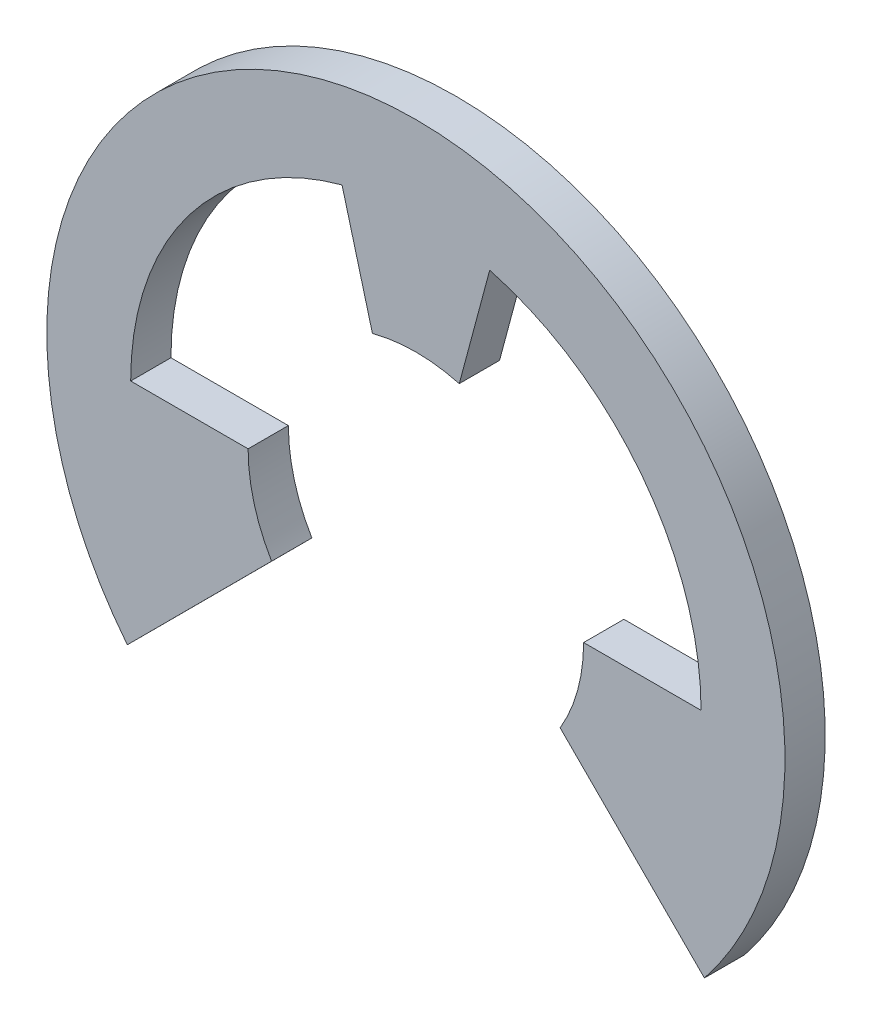
ISO-10303-21;
HEADER;
FILE_DESCRIPTION(('STEP AP214'),'2;1');
FILE_NAME('part.step','',(''),(''),'','','');
FILE_SCHEMA(('AUTOMOTIVE_DESIGN { 1 0 10303 214 1 1 1 1 }'));
ENDSEC;
DATA;
#1=APPLICATION_CONTEXT('core data for automotive mechanical design processes');
#2=APPLICATION_PROTOCOL_DEFINITION('international standard','automotive_design',2000,#1);
#3=PRODUCT_CONTEXT('',#1,'mechanical');
#4=PRODUCT('Part','Part','',(#3));
#5=PRODUCT_RELATED_PRODUCT_CATEGORY('part','',(#4));
#6=PRODUCT_DEFINITION_FORMATION('','',#4);
#7=PRODUCT_DEFINITION_CONTEXT('part definition',#1,'design');
#8=PRODUCT_DEFINITION('design','',#6,#7);
#9=PRODUCT_DEFINITION_SHAPE('','',#8);
#10=(LENGTH_UNIT() NAMED_UNIT(*) SI_UNIT(.MILLI.,.METRE.));
#11=(NAMED_UNIT(*) PLANE_ANGLE_UNIT() SI_UNIT($,.RADIAN.));
#12=(NAMED_UNIT(*) SI_UNIT($,.STERADIAN.) SOLID_ANGLE_UNIT());
#13=UNCERTAINTY_MEASURE_WITH_UNIT(LENGTH_MEASURE(1.E-05),#10,'distance_accuracy_value','');
#14=(GEOMETRIC_REPRESENTATION_CONTEXT(3) GLOBAL_UNCERTAINTY_ASSIGNED_CONTEXT((#13)) GLOBAL_UNIT_ASSIGNED_CONTEXT((#10,
#11,#12)) REPRESENTATION_CONTEXT('',''));
#15=CARTESIAN_POINT('',(0.,0.,0.));
#16=DIRECTION('',(0.,0.,1.));
#17=DIRECTION('',(1.,0.,0.));
#18=AXIS2_PLACEMENT_3D('',#15,#16,#17);
#19=CARTESIAN_POINT('',(2.15,-1.27573508221731,-0.3));
#20=DIRECTION('',(-0.707689924536374,-0.706523156527584,0.));
#21=DIRECTION('',(0.706523156527584,-0.707689924536374,0.));
#22=AXIS2_PLACEMENT_3D('',#19,#20,#21);
#23=PLANE('',#22);
#24=CARTESIAN_POINT('',(2.15000000000002,-1.27573508221731,0.3));
#25=CARTESIAN_POINT('',(2.23958333333335,-1.36546635545394,0.3));
#26=CARTESIAN_POINT('',(2.32916666666669,-1.45519762869057,0.3));
#27=CARTESIAN_POINT('',(2.50833333333335,-1.63466017516383,0.3));
#28=CARTESIAN_POINT('',(2.59791666666669,-1.72439144840046,0.3));
#29=CARTESIAN_POINT('',(2.77708333333335,-1.90385399487373,0.3));
#30=CARTESIAN_POINT('',(2.86666666666669,-1.99358526811036,0.3));
#31=CARTESIAN_POINT('',(3.04583333333336,-2.17304781458362,0.3));
#32=CARTESIAN_POINT('',(3.13541666666669,-2.26277908782025,0.3));
#33=CARTESIAN_POINT('',(3.31458333333336,-2.44224163429351,0.3));
#34=CARTESIAN_POINT('',(3.40416666666669,-2.53197290753015,0.3));
#35=CARTESIAN_POINT('',(3.58333333333336,-2.71143545400341,0.3));
#36=CARTESIAN_POINT('',(3.67291666666669,-2.80116672724004,0.3));
#37=CARTESIAN_POINT('',(3.85208333333336,-2.9806292737133,0.3));
#38=CARTESIAN_POINT('',(3.9416666666667,-3.07036054694993,0.3));
#39=CARTESIAN_POINT('',(4.12083333333336,-3.2498230934232,0.3));
#40=CARTESIAN_POINT('',(4.2104166666667,-3.33955436665983,0.3));
#41=CARTESIAN_POINT('',(4.30000000000003,-3.42928563989646,0.3));
#42=B_SPLINE_CURVE_WITH_KNOTS('',3,(#24,#25,#26,#27,#28,#29,#30,#31,#32,#33,#34,#35,#36,#37,#38,
#39,#40,#41),.UNSPECIFIED.,.F.,.F.,(4,2,2,2,2,2,2,2,4),(0.,0.380383852272942,0.760767704545884,
1.14115155681883,1.52153540909177,1.90191926136471,2.28230311363765,2.6626869659106,
3.04307081818354),.UNSPECIFIED.);
#43=CARTESIAN_POINT('',(2.15000009305852,-1.2757351754295,0.3));
#44=VERTEX_POINT('',#43);
#45=CARTESIAN_POINT('',(4.29999999999999,-3.42928563989646,0.3));
#46=VERTEX_POINT('',#45);
#47=EDGE_CURVE('E126',#44,#46,#42,.T.);
#48=ORIENTED_EDGE('',*,*,#47,.F.);
#49=DIRECTION('',(0.,0.,1.));
#50=VECTOR('',#49,1.);
#51=CARTESIAN_POINT('',(2.14999999999999,-1.27573508221731,0.));
#52=LINE('',#51,#50);
#53=CARTESIAN_POINT('',(2.14999999999999,-1.27573508221731,-0.3));
#54=VERTEX_POINT('',#53);
#55=EDGE_CURVE('E238',#54,#44,#52,.T.);
#56=ORIENTED_EDGE('',*,*,#55,.F.);
#57=CARTESIAN_POINT('',(4.30000000000003,-3.42928563989646,-0.3));
#58=CARTESIAN_POINT('',(4.2104166666667,-3.33955436665983,-0.3));
#59=CARTESIAN_POINT('',(4.12083333333336,-3.2498230934232,-0.3));
#60=CARTESIAN_POINT('',(3.94166666666669,-3.07036054694993,-0.3));
#61=CARTESIAN_POINT('',(3.85208333333336,-2.9806292737133,-0.3));
#62=CARTESIAN_POINT('',(3.67291666666669,-2.80116672724004,-0.3));
#63=CARTESIAN_POINT('',(3.58333333333336,-2.71143545400341,-0.3));
#64=CARTESIAN_POINT('',(3.40416666666669,-2.53197290753015,-0.3));
#65=CARTESIAN_POINT('',(3.31458333333336,-2.44224163429351,-0.3));
#66=CARTESIAN_POINT('',(3.13541666666669,-2.26277908782025,-0.3));
#67=CARTESIAN_POINT('',(3.04583333333335,-2.17304781458362,-0.3));
#68=CARTESIAN_POINT('',(2.86666666666669,-1.99358526811036,-0.3));
#69=CARTESIAN_POINT('',(2.77708333333335,-1.90385399487373,-0.3));
#70=CARTESIAN_POINT('',(2.59791666666668,-1.72439144840046,-0.3));
#71=CARTESIAN_POINT('',(2.50833333333335,-1.63466017516383,-0.3));
#72=CARTESIAN_POINT('',(2.32916666666668,-1.45519762869057,-0.3));
#73=CARTESIAN_POINT('',(2.23958333333335,-1.36546635545394,-0.3));
#74=CARTESIAN_POINT('',(2.15000000000001,-1.27573508221731,-0.3));
#75=B_SPLINE_CURVE_WITH_KNOTS('',3,(#57,#58,#59,#60,#61,#62,#63,#64,#65,#66,#67,#68,#69,#70,#71,
#72,#73,#74),.UNSPECIFIED.,.F.,.F.,(4,2,2,2,2,2,2,2,4),(0.,0.380383852272942,0.760767704545885,
1.14115155681883,1.52153540909177,1.90191926136471,2.28230311363765,2.6626869659106,
3.04307081818354),.UNSPECIFIED.);
#76=CARTESIAN_POINT('',(4.29999988915185,-3.42928552886524,-0.3));
#77=VERTEX_POINT('',#76);
#78=EDGE_CURVE('E190',#77,#54,#75,.T.);
#79=ORIENTED_EDGE('',*,*,#78,.F.);
#80=DIRECTION('',(0.,0.,-1.));
#81=VECTOR('',#80,1.);
#82=CARTESIAN_POINT('',(4.29999999999999,-3.42928563989646,0.));
#83=LINE('',#82,#81);
#84=EDGE_CURVE('E129',#46,#77,#83,.T.);
#85=ORIENTED_EDGE('',*,*,#84,.F.);
#86=EDGE_LOOP('',(#48,#56,#79,#85));
#87=FACE_BOUND('',#86,.T.);
#88=ADVANCED_FACE('F15',(#87),#23,.T.);
#89=CARTESIAN_POINT('',(0.,0.,0.3));
#90=DIRECTION('',(0.,0.,-1.));
#91=DIRECTION('',(-1.,0.,0.));
#92=AXIS2_PLACEMENT_3D('',#89,#90,#91);
#93=CYLINDRICAL_SURFACE('',#92,2.5);
#94=CARTESIAN_POINT('',(0.,0.,0.3));
#95=DIRECTION('',(0.,0.,-1.));
#96=DIRECTION('',(-1.,0.,0.));
#97=AXIS2_PLACEMENT_3D('',#94,#95,#96);
#98=CIRCLE('',#97,2.5);
#99=CARTESIAN_POINT('',(2.5,0.,0.3));
#100=VERTEX_POINT('',#99);
#101=EDGE_CURVE('E191',#100,#44,#98,.T.);
#102=ORIENTED_EDGE('',*,*,#101,.F.);
#103=DIRECTION('',(0.,0.,1.));
#104=VECTOR('',#103,1.);
#105=CARTESIAN_POINT('',(2.5,0.,0.));
#106=LINE('',#105,#104);
#107=CARTESIAN_POINT('',(2.5,0.,-0.3));
#108=VERTEX_POINT('',#107);
#109=EDGE_CURVE('E233',#108,#100,#106,.T.);
#110=ORIENTED_EDGE('',*,*,#109,.F.);
#111=CARTESIAN_POINT('',(0.,0.,-0.3));
#112=DIRECTION('',(0.,0.,-1.));
#113=DIRECTION('',(-1.,0.,0.));
#114=AXIS2_PLACEMENT_3D('',#111,#112,#113);
#115=CIRCLE('',#114,2.5);
#116=EDGE_CURVE('E187',#54,#108,#115,.F.);
#117=ORIENTED_EDGE('',*,*,#116,.F.);
#118=ORIENTED_EDGE('',*,*,#55,.T.);
#119=EDGE_LOOP('',(#102,#110,#117,#118));
#120=FACE_BOUND('',#119,.T.);
#121=ADVANCED_FACE('F289',(#120),#93,.F.);
#122=CARTESIAN_POINT('',(2.5,0.,-0.3));
#123=DIRECTION('',(0.,1.,0.));
#124=DIRECTION('',(0.,0.,1.));
#125=AXIS2_PLACEMENT_3D('',#122,#123,#124);
#126=PLANE('',#125);
#127=DIRECTION('',(-1.,0.,0.));
#128=VECTOR('',#127,1.);
#129=CARTESIAN_POINT('',(0.,0.,0.3));
#130=LINE('',#129,#128);
#131=CARTESIAN_POINT('',(4.25,0.,0.3));
#132=VERTEX_POINT('',#131);
#133=EDGE_CURVE('E194',#132,#100,#130,.T.);
#134=ORIENTED_EDGE('',*,*,#133,.F.);
#135=DIRECTION('',(0.,0.,1.));
#136=VECTOR('',#135,1.);
#137=CARTESIAN_POINT('',(4.25,0.,0.));
#138=LINE('',#137,#136);
#139=CARTESIAN_POINT('',(4.25,0.,-0.3));
#140=VERTEX_POINT('',#139);
#141=EDGE_CURVE('E226',#140,#132,#138,.T.);
#142=ORIENTED_EDGE('',*,*,#141,.F.);
#143=DIRECTION('',(1.,0.,0.));
#144=VECTOR('',#143,1.);
#145=CARTESIAN_POINT('',(0.,0.,-0.3));
#146=LINE('',#145,#144);
#147=EDGE_CURVE('E186',#108,#140,#146,.T.);
#148=ORIENTED_EDGE('',*,*,#147,.F.);
#149=ORIENTED_EDGE('',*,*,#109,.T.);
#150=EDGE_LOOP('',(#134,#142,#148,#149));
#151=FACE_BOUND('',#150,.T.);
#152=ADVANCED_FACE('F235',(#151),#126,.T.);
#153=CARTESIAN_POINT('',(0.,0.,0.3));
#154=DIRECTION('',(0.,0.,-1.));
#155=DIRECTION('',(-1.,0.,0.));
#156=AXIS2_PLACEMENT_3D('',#153,#154,#155);
#157=CYLINDRICAL_SURFACE('',#156,4.25);
#158=CARTESIAN_POINT('',(0.,0.,0.3));
#159=DIRECTION('',(0.,0.,-1.));
#160=DIRECTION('',(-1.,0.,0.));
#161=AXIS2_PLACEMENT_3D('',#158,#159,#160);
#162=CIRCLE('',#161,4.25);
#163=CARTESIAN_POINT('',(1.09998094168572,4.10518476172854,0.3));
#164=VERTEX_POINT('',#163);
#165=EDGE_CURVE('E195',#164,#132,#162,.T.);
#166=ORIENTED_EDGE('',*,*,#165,.F.);
#167=DIRECTION('',(0.,0.,1.));
#168=VECTOR('',#167,1.);
#169=CARTESIAN_POINT('',(1.09998094168571,4.10518476172854,-0.3));
#170=LINE('',#169,#168);
#171=CARTESIAN_POINT('',(1.0999809416857,4.10518476172854,-0.3));
#172=VERTEX_POINT('',#171);
#173=EDGE_CURVE('E222',#172,#164,#170,.T.);
#174=ORIENTED_EDGE('',*,*,#173,.F.);
#175=CARTESIAN_POINT('',(0.,0.,-0.3));
#176=DIRECTION('',(0.,0.,-1.));
#177=DIRECTION('',(-1.,0.,0.));
#178=AXIS2_PLACEMENT_3D('',#175,#176,#177);
#179=CIRCLE('',#178,4.25);
#180=EDGE_CURVE('E183',#140,#172,#179,.F.);
#181=ORIENTED_EDGE('',*,*,#180,.F.);
#182=ORIENTED_EDGE('',*,*,#141,.T.);
#183=EDGE_LOOP('',(#166,#174,#181,#182));
#184=FACE_BOUND('',#183,.T.);
#185=ADVANCED_FACE('F228',(#184),#157,.F.);
#186=CARTESIAN_POINT('',(0.6470476127563,2.41481456572267,-0.3));
#187=DIRECTION('',(0.965925826289068,-0.25881904510252,0.));
#188=DIRECTION('',(0.25881904510252,0.965925826289068,0.));
#189=AXIS2_PLACEMENT_3D('',#186,#187,#188);
#190=PLANE('',#189);
#191=CARTESIAN_POINT('',(0.647047612756252,2.41481456572263,0.3));
#192=CARTESIAN_POINT('',(0.665919834794979,2.48524665722288,0.3));
#193=CARTESIAN_POINT('',(0.684792056833706,2.55567874872313,0.3));
#194=CARTESIAN_POINT('',(0.722536500911159,2.69654293172362,0.3));
#195=CARTESIAN_POINT('',(0.741408722949885,2.76697502322386,0.3));
#196=CARTESIAN_POINT('',(0.779153167027339,2.90783920622436,0.3));
#197=CARTESIAN_POINT('',(0.798025389066065,2.9782712977246,0.3));
#198=CARTESIAN_POINT('',(0.835769833143519,3.11913548072509,0.3));
#199=CARTESIAN_POINT('',(0.854642055182246,3.18956757222534,0.3));
#200=CARTESIAN_POINT('',(0.892386499259699,3.33043175522583,0.3));
#201=CARTESIAN_POINT('',(0.911258721298427,3.40086384672608,0.3));
#202=CARTESIAN_POINT('',(0.949003165375881,3.54172802972657,0.3));
#203=CARTESIAN_POINT('',(0.967875387414607,3.61216012122682,0.3));
#204=CARTESIAN_POINT('',(1.00561983149206,3.75302430422731,0.3));
#205=CARTESIAN_POINT('',(1.02449205353079,3.82345639572755,0.3));
#206=CARTESIAN_POINT('',(1.06223649760824,3.96432057872804,0.3));
#207=CARTESIAN_POINT('',(1.08110871964697,4.03475267022829,0.3));
#208=CARTESIAN_POINT('',(1.09998094168569,4.10518476172854,0.3));
#209=B_SPLINE_CURVE_WITH_KNOTS('',3,(#191,#192,#193,#194,#195,#196,#197,#198,#199,#200,#201,
#202,#203,#204,#205,#206,#207,#208),.UNSPECIFIED.,.F.,.F.,(4,2,2,2,2,2,2,2,4),(0.,
0.218750000000005,0.437500000000009,0.656250000000014,0.875000000000019,1.09375000000002,
1.31250000000003,1.53125000000003,1.75000000000004),.UNSPECIFIED.);
#210=CARTESIAN_POINT('',(0.647047612756282,2.41481456572265,0.3));
#211=VERTEX_POINT('',#210);
#212=EDGE_CURVE('E157',#211,#164,#209,.T.);
#213=ORIENTED_EDGE('',*,*,#212,.F.);
#214=DIRECTION('',(0.,0.,1.));
#215=VECTOR('',#214,1.);
#216=CARTESIAN_POINT('',(0.647047612756311,2.41481456572267,0.));
#217=LINE('',#216,#215);
#218=CARTESIAN_POINT('',(0.647047612756311,2.41481456572267,-0.3));
#219=VERTEX_POINT('',#218);
#220=EDGE_CURVE('E213',#219,#211,#217,.T.);
#221=ORIENTED_EDGE('',*,*,#220,.F.);
#222=CARTESIAN_POINT('',(1.09998094168569,4.10518476172854,-0.3));
#223=CARTESIAN_POINT('',(1.08110871964696,4.03475267022829,-0.3));
#224=CARTESIAN_POINT('',(1.06223649760824,3.96432057872804,-0.3));
#225=CARTESIAN_POINT('',(1.02449205353078,3.82345639572755,-0.3));
#226=CARTESIAN_POINT('',(1.00561983149206,3.75302430422731,-0.3));
#227=CARTESIAN_POINT('',(0.967875387414604,3.61216012122681,-0.3));
#228=CARTESIAN_POINT('',(0.949003165375878,3.54172802972657,-0.3));
#229=CARTESIAN_POINT('',(0.911258721298424,3.40086384672608,-0.3));
#230=CARTESIAN_POINT('',(0.892386499259698,3.33043175522583,-0.3));
#231=CARTESIAN_POINT('',(0.854642055182244,3.18956757222534,-0.3));
#232=CARTESIAN_POINT('',(0.835769833143516,3.11913548072509,-0.3));
#233=CARTESIAN_POINT('',(0.798025389066063,2.9782712977246,-0.3));
#234=CARTESIAN_POINT('',(0.779153167027336,2.90783920622436,-0.3));
#235=CARTESIAN_POINT('',(0.741408722949883,2.76697502322386,-0.3));
#236=CARTESIAN_POINT('',(0.722536500911156,2.69654293172362,-0.3));
#237=CARTESIAN_POINT('',(0.684792056833702,2.55567874872313,-0.3));
#238=CARTESIAN_POINT('',(0.665919834794976,2.48524665722288,-0.3));
#239=CARTESIAN_POINT('',(0.647047612756249,2.41481456572263,-0.3));
#240=B_SPLINE_CURVE_WITH_KNOTS('',3,(#222,#223,#224,#225,#226,#227,#228,#229,#230,#231,#232,
#233,#234,#235,#236,#237,#238,#239),.UNSPECIFIED.,.F.,.F.,(4,2,2,2,2,2,2,2,4),(0.,
0.218750000000005,0.437500000000009,0.656250000000015,0.875000000000019,1.09375000000002,
1.31250000000003,1.53125000000003,1.75000000000004),.UNSPECIFIED.);
#241=EDGE_CURVE('E182',#172,#219,#240,.T.);
#242=ORIENTED_EDGE('',*,*,#241,.F.);
#243=ORIENTED_EDGE('',*,*,#173,.T.);
#244=EDGE_LOOP('',(#213,#221,#242,#243));
#245=FACE_BOUND('',#244,.T.);
#246=ADVANCED_FACE('F220',(#245),#190,.T.);
#247=CARTESIAN_POINT('',(0.,0.,0.3));
#248=DIRECTION('',(0.,0.,-1.));
#249=DIRECTION('',(-1.,0.,0.));
#250=AXIS2_PLACEMENT_3D('',#247,#248,#249);
#251=CYLINDRICAL_SURFACE('',#250,2.5);
#252=CARTESIAN_POINT('',(0.,0.,0.3));
#253=DIRECTION('',(0.,0.,-1.));
#254=DIRECTION('',(-1.,0.,0.));
#255=AXIS2_PLACEMENT_3D('',#252,#253,#254);
#256=CIRCLE('',#255,2.5);
#257=CARTESIAN_POINT('',(-0.647047612756298,2.41481456572267,0.3));
#258=VERTEX_POINT('',#257);
#259=EDGE_CURVE('E163',#258,#211,#256,.T.);
#260=ORIENTED_EDGE('',*,*,#259,.F.);
#261=DIRECTION('',(0.,0.,1.));
#262=VECTOR('',#261,1.);
#263=CARTESIAN_POINT('',(-0.6470476127563,2.41481456572267,-0.3));
#264=LINE('',#263,#262);
#265=CARTESIAN_POINT('',(-0.647047612756276,2.41481456572265,-0.3));
#266=VERTEX_POINT('',#265);
#267=EDGE_CURVE('E207',#266,#258,#264,.T.);
#268=ORIENTED_EDGE('',*,*,#267,.F.);
#269=CARTESIAN_POINT('',(0.,0.,-0.3));
#270=DIRECTION('',(0.,0.,-1.));
#271=DIRECTION('',(-1.,0.,0.));
#272=AXIS2_PLACEMENT_3D('',#269,#270,#271);
#273=CIRCLE('',#272,2.5);
#274=EDGE_CURVE('E179',#219,#266,#273,.F.);
#275=ORIENTED_EDGE('',*,*,#274,.F.);
#276=ORIENTED_EDGE('',*,*,#220,.T.);
#277=EDGE_LOOP('',(#260,#268,#275,#276));
#278=FACE_BOUND('',#277,.T.);
#279=ADVANCED_FACE('F215',(#278),#251,.F.);
#280=CARTESIAN_POINT('',(-1.09998094168571,4.10518476172854,-0.3));
#281=DIRECTION('',(-0.965925826289068,-0.25881904510252,0.));
#282=DIRECTION('',(0.25881904510252,-0.965925826289068,0.));
#283=AXIS2_PLACEMENT_3D('',#280,#281,#282);
#284=PLANE('',#283);
#285=CARTESIAN_POINT('',(-1.09998094168569,4.10518476172854,0.3));
#286=CARTESIAN_POINT('',(-1.08110871964696,4.03475267022829,0.3));
#287=CARTESIAN_POINT('',(-1.06223649760824,3.96432057872804,0.3));
#288=CARTESIAN_POINT('',(-1.02449205353078,3.82345639572755,0.3));
#289=CARTESIAN_POINT('',(-1.00561983149206,3.75302430422731,0.3));
#290=CARTESIAN_POINT('',(-0.967875387414604,3.61216012122682,0.3));
#291=CARTESIAN_POINT('',(-0.949003165375878,3.54172802972657,0.3));
#292=CARTESIAN_POINT('',(-0.911258721298424,3.40086384672608,0.3));
#293=CARTESIAN_POINT('',(-0.892386499259698,3.33043175522583,0.3));
#294=CARTESIAN_POINT('',(-0.854642055182244,3.18956757222534,0.3));
#295=CARTESIAN_POINT('',(-0.835769833143516,3.11913548072509,0.3));
#296=CARTESIAN_POINT('',(-0.798025389066063,2.9782712977246,0.3));
#297=CARTESIAN_POINT('',(-0.779153167027336,2.90783920622436,0.3));
#298=CARTESIAN_POINT('',(-0.741408722949883,2.76697502322386,0.3));
#299=CARTESIAN_POINT('',(-0.722536500911156,2.69654293172362,0.3));
#300=CARTESIAN_POINT('',(-0.684792056833702,2.55567874872313,0.3));
#301=CARTESIAN_POINT('',(-0.665919834794976,2.48524665722288,0.3));
#302=CARTESIAN_POINT('',(-0.647047612756249,2.41481456572263,0.3));
#303=B_SPLINE_CURVE_WITH_KNOTS('',3,(#285,#286,#287,#288,#289,#290,#291,#292,#293,#294,#295,
#296,#297,#298,#299,#300,#301,#302),.UNSPECIFIED.,.F.,.F.,(4,2,2,2,2,2,2,2,4),(0.,
0.218750000000005,0.437500000000009,0.656250000000014,0.875000000000019,1.09375000000002,
1.31250000000003,1.53125000000003,1.75000000000004),.UNSPECIFIED.);
#304=CARTESIAN_POINT('',(-1.0999809416857,4.10518476172854,0.3));
#305=VERTEX_POINT('',#304);
#306=EDGE_CURVE('E160',#305,#258,#303,.T.);
#307=ORIENTED_EDGE('',*,*,#306,.F.);
#308=DIRECTION('',(0.,0.,1.));
#309=VECTOR('',#308,1.);
#310=CARTESIAN_POINT('',(-1.0999809416857,4.10518476172854,0.));
#311=LINE('',#310,#309);
#312=CARTESIAN_POINT('',(-1.0999809416857,4.10518476172854,-0.3));
#313=VERTEX_POINT('',#312);
#314=EDGE_CURVE('E203',#313,#305,#311,.T.);
#315=ORIENTED_EDGE('',*,*,#314,.F.);
#316=CARTESIAN_POINT('',(-0.647047612756252,2.41481456572263,-0.3));
#317=CARTESIAN_POINT('',(-0.665919834794979,2.48524665722288,-0.3));
#318=CARTESIAN_POINT('',(-0.684792056833706,2.55567874872313,-0.3));
#319=CARTESIAN_POINT('',(-0.722536500911159,2.69654293172362,-0.3));
#320=CARTESIAN_POINT('',(-0.741408722949885,2.76697502322386,-0.3));
#321=CARTESIAN_POINT('',(-0.779153167027339,2.90783920622436,-0.3));
#322=CARTESIAN_POINT('',(-0.798025389066065,2.9782712977246,-0.3));
#323=CARTESIAN_POINT('',(-0.835769833143519,3.11913548072509,-0.3));
#324=CARTESIAN_POINT('',(-0.854642055182246,3.18956757222534,-0.3));
#325=CARTESIAN_POINT('',(-0.892386499259699,3.33043175522583,-0.3));
#326=CARTESIAN_POINT('',(-0.911258721298427,3.40086384672608,-0.3));
#327=CARTESIAN_POINT('',(-0.949003165375881,3.54172802972657,-0.3));
#328=CARTESIAN_POINT('',(-0.967875387414607,3.61216012122682,-0.3));
#329=CARTESIAN_POINT('',(-1.00561983149206,3.75302430422731,-0.3));
#330=CARTESIAN_POINT('',(-1.02449205353079,3.82345639572755,-0.3));
#331=CARTESIAN_POINT('',(-1.06223649760824,3.96432057872804,-0.3));
#332=CARTESIAN_POINT('',(-1.08110871964697,4.03475267022829,-0.3));
#333=CARTESIAN_POINT('',(-1.09998094168569,4.10518476172854,-0.3));
#334=B_SPLINE_CURVE_WITH_KNOTS('',3,(#316,#317,#318,#319,#320,#321,#322,#323,#324,#325,#326,
#327,#328,#329,#330,#331,#332,#333),.UNSPECIFIED.,.F.,.F.,(4,2,2,2,2,2,2,2,4),(0.,
0.218750000000005,0.437500000000009,0.656250000000014,0.875000000000019,1.09375000000002,
1.31250000000003,1.53125000000003,1.75000000000004),.UNSPECIFIED.);
#335=EDGE_CURVE('E178',#266,#313,#334,.T.);
#336=ORIENTED_EDGE('',*,*,#335,.F.);
#337=ORIENTED_EDGE('',*,*,#267,.T.);
#338=EDGE_LOOP('',(#307,#315,#336,#337));
#339=FACE_BOUND('',#338,.T.);
#340=ADVANCED_FACE('F209',(#339),#284,.T.);
#341=CARTESIAN_POINT('',(0.,0.,0.3));
#342=DIRECTION('',(0.,0.,-1.));
#343=DIRECTION('',(-1.,0.,0.));
#344=AXIS2_PLACEMENT_3D('',#341,#342,#343);
#345=CYLINDRICAL_SURFACE('',#344,4.25);
#346=CARTESIAN_POINT('',(0.,0.,0.3));
#347=DIRECTION('',(0.,0.,-1.));
#348=DIRECTION('',(-1.,0.,0.));
#349=AXIS2_PLACEMENT_3D('',#346,#347,#348);
#350=CIRCLE('',#349,4.25);
#351=CARTESIAN_POINT('',(-4.25,0.,0.3));
#352=VERTEX_POINT('',#351);
#353=EDGE_CURVE('E120',#352,#305,#350,.T.);
#354=ORIENTED_EDGE('',*,*,#353,.F.);
#355=DIRECTION('',(0.,0.,1.));
#356=VECTOR('',#355,1.);
#357=CARTESIAN_POINT('',(-4.25,0.,0.));
#358=LINE('',#357,#356);
#359=CARTESIAN_POINT('',(-4.25,0.,-0.3));
#360=VERTEX_POINT('',#359);
#361=EDGE_CURVE('E112',#360,#352,#358,.T.);
#362=ORIENTED_EDGE('',*,*,#361,.F.);
#363=CARTESIAN_POINT('',(0.,0.,-0.3));
#364=DIRECTION('',(0.,0.,-1.));
#365=DIRECTION('',(-1.,0.,0.));
#366=AXIS2_PLACEMENT_3D('',#363,#364,#365);
#367=CIRCLE('',#366,4.25);
#368=EDGE_CURVE('E175',#313,#360,#367,.F.);
#369=ORIENTED_EDGE('',*,*,#368,.F.);
#370=ORIENTED_EDGE('',*,*,#314,.T.);
#371=EDGE_LOOP('',(#354,#362,#369,#370));
#372=FACE_BOUND('',#371,.T.);
#373=ADVANCED_FACE('F201',(#372),#345,.F.);
#374=CARTESIAN_POINT('',(-4.25,0.,-0.3));
#375=DIRECTION('',(0.,1.,0.));
#376=DIRECTION('',(0.,0.,1.));
#377=AXIS2_PLACEMENT_3D('',#374,#375,#376);
#378=PLANE('',#377);
#379=DIRECTION('',(-1.,0.,0.));
#380=VECTOR('',#379,1.);
#381=CARTESIAN_POINT('',(0.,0.,0.3));
#382=LINE('',#381,#380);
#383=CARTESIAN_POINT('',(-2.5,0.,0.3));
#384=VERTEX_POINT('',#383);
#385=EDGE_CURVE('E115',#384,#352,#382,.T.);
#386=ORIENTED_EDGE('',*,*,#385,.F.);
#387=DIRECTION('',(0.,0.,1.));
#388=VECTOR('',#387,1.);
#389=CARTESIAN_POINT('',(-2.5,0.,0.));
#390=LINE('',#389,#388);
#391=CARTESIAN_POINT('',(-2.5,0.,-0.3));
#392=VERTEX_POINT('',#391);
#393=EDGE_CURVE('E101',#392,#384,#390,.T.);
#394=ORIENTED_EDGE('',*,*,#393,.F.);
#395=DIRECTION('',(1.,0.,0.));
#396=VECTOR('',#395,1.);
#397=CARTESIAN_POINT('',(0.,0.,-0.3));
#398=LINE('',#397,#396);
#399=EDGE_CURVE('E174',#360,#392,#398,.T.);
#400=ORIENTED_EDGE('',*,*,#399,.F.);
#401=ORIENTED_EDGE('',*,*,#361,.T.);
#402=EDGE_LOOP('',(#386,#394,#400,#401));
#403=FACE_BOUND('',#402,.T.);
#404=ADVANCED_FACE('F116',(#403),#378,.T.);
#405=CARTESIAN_POINT('',(0.,0.,0.3));
#406=DIRECTION('',(0.,0.,-1.));
#407=DIRECTION('',(-1.,0.,0.));
#408=AXIS2_PLACEMENT_3D('',#405,#406,#407);
#409=CYLINDRICAL_SURFACE('',#408,2.5);
#410=CARTESIAN_POINT('',(0.,0.,0.3));
#411=DIRECTION('',(0.,0.,-1.));
#412=DIRECTION('',(-1.,0.,0.));
#413=AXIS2_PLACEMENT_3D('',#410,#411,#412);
#414=CIRCLE('',#413,2.5);
#415=CARTESIAN_POINT('',(-2.15,-1.27573508221731,0.3));
#416=VERTEX_POINT('',#415);
#417=EDGE_CURVE('E18',#416,#384,#414,.T.);
#418=ORIENTED_EDGE('',*,*,#417,.F.);
#419=DIRECTION('',(0.,0.,1.));
#420=VECTOR('',#419,1.);
#421=CARTESIAN_POINT('',(-2.15,-1.27573508221731,-0.3));
#422=LINE('',#421,#420);
#423=CARTESIAN_POINT('',(-2.15000000000001,-1.27573508221731,-0.3));
#424=VERTEX_POINT('',#423);
#425=EDGE_CURVE('E111',#424,#416,#422,.T.);
#426=ORIENTED_EDGE('',*,*,#425,.F.);
#427=CARTESIAN_POINT('',(0.,0.,-0.3));
#428=DIRECTION('',(0.,0.,-1.));
#429=DIRECTION('',(-1.,0.,0.));
#430=AXIS2_PLACEMENT_3D('',#427,#428,#429);
#431=CIRCLE('',#430,2.5);
#432=EDGE_CURVE('E107',#392,#424,#431,.F.);
#433=ORIENTED_EDGE('',*,*,#432,.F.);
#434=ORIENTED_EDGE('',*,*,#393,.T.);
#435=EDGE_LOOP('',(#418,#426,#433,#434));
#436=FACE_BOUND('',#435,.T.);
#437=ADVANCED_FACE('F103',(#436),#409,.F.);
#438=CARTESIAN_POINT('',(-4.3,-3.42928563989645,-0.3));
#439=DIRECTION('',(0.707689924536374,-0.706523156527584,0.));
#440=DIRECTION('',(0.706523156527584,0.707689924536374,0.));
#441=AXIS2_PLACEMENT_3D('',#438,#439,#440);
#442=PLANE('',#441);
#443=CARTESIAN_POINT('',(-4.30000000000003,-3.42928563989646,0.3));
#444=CARTESIAN_POINT('',(-4.2104166666667,-3.33955436665983,0.3));
#445=CARTESIAN_POINT('',(-4.12083333333336,-3.2498230934232,0.3));
#446=CARTESIAN_POINT('',(-3.94166666666669,-3.07036054694993,0.3));
#447=CARTESIAN_POINT('',(-3.85208333333336,-2.9806292737133,0.3));
#448=CARTESIAN_POINT('',(-3.67291666666669,-2.80116672724004,0.3));
#449=CARTESIAN_POINT('',(-3.58333333333336,-2.71143545400341,0.3));
#450=CARTESIAN_POINT('',(-3.40416666666669,-2.53197290753015,0.3));
#451=CARTESIAN_POINT('',(-3.31458333333336,-2.44224163429351,0.3));
#452=CARTESIAN_POINT('',(-3.13541666666669,-2.26277908782025,0.3));
#453=CARTESIAN_POINT('',(-3.04583333333335,-2.17304781458362,0.3));
#454=CARTESIAN_POINT('',(-2.86666666666669,-1.99358526811036,0.3));
#455=CARTESIAN_POINT('',(-2.77708333333335,-1.90385399487373,0.3));
#456=CARTESIAN_POINT('',(-2.59791666666668,-1.72439144840046,0.3));
#457=CARTESIAN_POINT('',(-2.50833333333335,-1.63466017516383,0.3));
#458=CARTESIAN_POINT('',(-2.32916666666668,-1.45519762869057,0.3));
#459=CARTESIAN_POINT('',(-2.23958333333335,-1.36546635545394,0.3));
#460=CARTESIAN_POINT('',(-2.15000000000001,-1.27573508221731,0.3));
#461=B_SPLINE_CURVE_WITH_KNOTS('',3,(#443,#444,#445,#446,#447,#448,#449,#450,#451,#452,#453,
#454,#455,#456,#457,#458,#459,#460),.UNSPECIFIED.,.F.,.F.,(4,2,2,2,2,2,2,2,4),(0.,
0.380383852272942,0.760767704545885,1.14115155681883,1.52153540909177,1.90191926136471,
2.28230311363765,2.6626869659106,3.04307081818354),.UNSPECIFIED.);
#462=CARTESIAN_POINT('',(-4.29999998583667,-3.42928562570972,0.3));
#463=VERTEX_POINT('',#462);
#464=EDGE_CURVE('E125',#463,#416,#461,.T.);
#465=ORIENTED_EDGE('',*,*,#464,.F.);
#466=DIRECTION('',(0.,0.,1.));
#467=VECTOR('',#466,1.);
#468=CARTESIAN_POINT('',(-4.3,-3.42928563989645,-0.3));
#469=LINE('',#468,#467);
#470=CARTESIAN_POINT('',(-4.29999988915185,-3.42928552886524,-0.3));
#471=VERTEX_POINT('',#470);
#472=EDGE_CURVE('E33',#463,#471,#469,.F.);
#473=ORIENTED_EDGE('',*,*,#472,.T.);
#474=CARTESIAN_POINT('',(-2.15000000000002,-1.27573508221731,-0.3));
#475=CARTESIAN_POINT('',(-2.23958333333335,-1.36546635545394,-0.3));
#476=CARTESIAN_POINT('',(-2.32916666666669,-1.45519762869057,-0.3));
#477=CARTESIAN_POINT('',(-2.50833333333335,-1.63466017516383,-0.3));
#478=CARTESIAN_POINT('',(-2.59791666666669,-1.72439144840046,-0.3));
#479=CARTESIAN_POINT('',(-2.77708333333335,-1.90385399487373,-0.3));
#480=CARTESIAN_POINT('',(-2.86666666666669,-1.99358526811036,-0.3));
#481=CARTESIAN_POINT('',(-3.04583333333336,-2.17304781458362,-0.3));
#482=CARTESIAN_POINT('',(-3.13541666666669,-2.26277908782025,-0.3));
#483=CARTESIAN_POINT('',(-3.31458333333336,-2.44224163429351,-0.3));
#484=CARTESIAN_POINT('',(-3.40416666666669,-2.53197290753015,-0.3));
#485=CARTESIAN_POINT('',(-3.58333333333336,-2.71143545400341,-0.3));
#486=CARTESIAN_POINT('',(-3.67291666666669,-2.80116672724004,-0.3));
#487=CARTESIAN_POINT('',(-3.85208333333336,-2.9806292737133,-0.3));
#488=CARTESIAN_POINT('',(-3.9416666666667,-3.07036054694993,-0.3));
#489=CARTESIAN_POINT('',(-4.12083333333336,-3.2498230934232,-0.3));
#490=CARTESIAN_POINT('',(-4.2104166666667,-3.33955436665983,-0.3));
#491=CARTESIAN_POINT('',(-4.30000000000003,-3.42928563989646,-0.3));
#492=B_SPLINE_CURVE_WITH_KNOTS('',3,(#474,#475,#476,#477,#478,#479,#480,#481,#482,#483,#484,
#485,#486,#487,#488,#489,#490,#491),.UNSPECIFIED.,.F.,.F.,(4,2,2,2,2,2,2,2,4),(0.,
0.380383852272942,0.760767704545884,1.14115155681883,1.52153540909177,1.90191926136471,
2.28230311363765,2.6626869659106,3.04307081818354),.UNSPECIFIED.);
#493=EDGE_CURVE('E172',#424,#471,#492,.T.);
#494=ORIENTED_EDGE('',*,*,#493,.F.);
#495=ORIENTED_EDGE('',*,*,#425,.T.);
#496=EDGE_LOOP('',(#465,#473,#494,#495));
#497=FACE_BOUND('',#496,.T.);
#498=ADVANCED_FACE('F302',(#497),#442,.T.);
#499=CARTESIAN_POINT('',(-5.566,-3.48308986745241,0.3));
#500=DIRECTION('',(0.,0.,1.));
#501=DIRECTION('',(1.,0.,0.));
#502=AXIS2_PLACEMENT_3D('',#499,#500,#501);
#503=PLANE('',#502);
#504=ORIENTED_EDGE('',*,*,#133,.T.);
#505=ORIENTED_EDGE('',*,*,#101,.T.);
#506=ORIENTED_EDGE('',*,*,#47,.T.);
#507=CARTESIAN_POINT('',(0.,0.,0.3));
#508=DIRECTION('',(0.,0.,-1.));
#509=DIRECTION('',(-1.,0.,0.));
#510=AXIS2_PLACEMENT_3D('',#507,#508,#509);
#511=CIRCLE('',#510,5.5);
#512=EDGE_CURVE('E24',#463,#46,#511,.T.);
#513=ORIENTED_EDGE('',*,*,#512,.F.);
#514=ORIENTED_EDGE('',*,*,#464,.T.);
#515=ORIENTED_EDGE('',*,*,#417,.T.);
#516=ORIENTED_EDGE('',*,*,#385,.T.);
#517=ORIENTED_EDGE('',*,*,#353,.T.);
#518=ORIENTED_EDGE('',*,*,#306,.T.);
#519=ORIENTED_EDGE('',*,*,#259,.T.);
#520=ORIENTED_EDGE('',*,*,#212,.T.);
#521=ORIENTED_EDGE('',*,*,#165,.T.);
#522=EDGE_LOOP('',(#504,#505,#506,#513,#514,#515,#516,#517,#518,#519,#520,#521));
#523=FACE_BOUND('',#522,.T.);
#524=ADVANCED_FACE('F123',(#523),#503,.T.);
#525=CARTESIAN_POINT('',(5.566,-3.48308986745241,-0.3));
#526=DIRECTION('',(0.,0.,-1.));
#527=DIRECTION('',(-1.,0.,0.));
#528=AXIS2_PLACEMENT_3D('',#525,#526,#527);
#529=PLANE('',#528);
#530=CARTESIAN_POINT('',(0.,0.,-0.3));
#531=DIRECTION('',(0.,0.,-1.));
#532=DIRECTION('',(-1.,0.,0.));
#533=AXIS2_PLACEMENT_3D('',#530,#531,#532);
#534=CIRCLE('',#533,5.5);
#535=EDGE_CURVE('E10',#77,#471,#534,.F.);
#536=ORIENTED_EDGE('',*,*,#535,.F.);
#537=ORIENTED_EDGE('',*,*,#78,.T.);
#538=ORIENTED_EDGE('',*,*,#116,.T.);
#539=ORIENTED_EDGE('',*,*,#147,.T.);
#540=ORIENTED_EDGE('',*,*,#180,.T.);
#541=ORIENTED_EDGE('',*,*,#241,.T.);
#542=ORIENTED_EDGE('',*,*,#274,.T.);
#543=ORIENTED_EDGE('',*,*,#335,.T.);
#544=ORIENTED_EDGE('',*,*,#368,.T.);
#545=ORIENTED_EDGE('',*,*,#399,.T.);
#546=ORIENTED_EDGE('',*,*,#432,.T.);
#547=ORIENTED_EDGE('',*,*,#493,.T.);
#548=EDGE_LOOP('',(#536,#537,#538,#539,#540,#541,#542,#543,#544,#545,#546,#547));
#549=FACE_BOUND('',#548,.T.);
#550=ADVANCED_FACE('F148',(#549),#529,.T.);
#551=CARTESIAN_POINT('',(0.,0.,-0.3));
#552=DIRECTION('',(0.,0.,-1.));
#553=DIRECTION('',(-1.,0.,0.));
#554=AXIS2_PLACEMENT_3D('',#551,#552,#553);
#555=CYLINDRICAL_SURFACE('',#554,5.5);
#556=ORIENTED_EDGE('',*,*,#535,.T.);
#557=ORIENTED_EDGE('',*,*,#472,.F.);
#558=ORIENTED_EDGE('',*,*,#512,.T.);
#559=ORIENTED_EDGE('',*,*,#84,.T.);
#560=EDGE_LOOP('',(#556,#557,#558,#559));
#561=FACE_BOUND('',#560,.T.);
#562=ADVANCED_FACE('F253',(#561),#555,.T.);
#563=CLOSED_SHELL('',(#88,#121,#152,#185,#246,#279,#340,#373,#404,#437,#498,#524,#550,#562));
#564=MANIFOLD_SOLID_BREP('B1',#563);
#565=ADVANCED_BREP_SHAPE_REPRESENTATION('',(#18,#564),#14);
#566=SHAPE_DEFINITION_REPRESENTATION(#9,#565);
ENDSEC;
END-ISO-10303-21;
